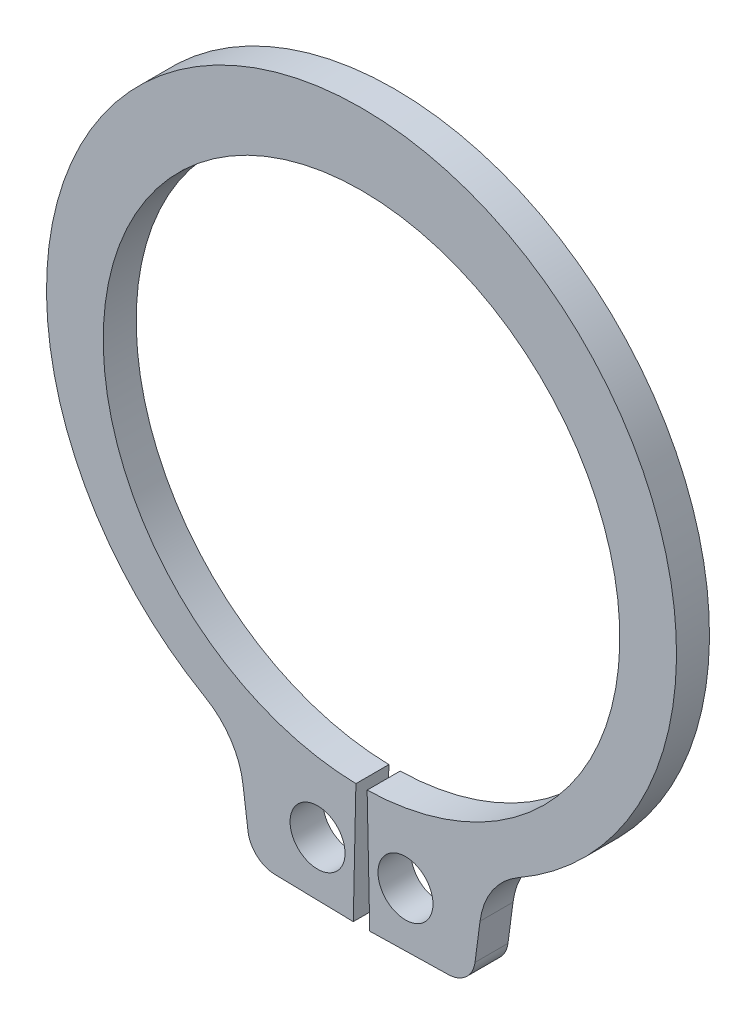
ISO-10303-21;
HEADER;
FILE_DESCRIPTION(('STEP AP214'),'2;1');
FILE_NAME('part.step','',(''),(''),'','','');
FILE_SCHEMA(('AUTOMOTIVE_DESIGN { 1 0 10303 214 1 1 1 1 }'));
ENDSEC;
DATA;
#1=APPLICATION_CONTEXT('core data for automotive mechanical design processes');
#2=APPLICATION_PROTOCOL_DEFINITION('international standard','automotive_design',2000,#1);
#3=PRODUCT_CONTEXT('',#1,'mechanical');
#4=PRODUCT('Part','Part','',(#3));
#5=PRODUCT_RELATED_PRODUCT_CATEGORY('part','',(#4));
#6=PRODUCT_DEFINITION_FORMATION('','',#4);
#7=PRODUCT_DEFINITION_CONTEXT('part definition',#1,'design');
#8=PRODUCT_DEFINITION('design','',#6,#7);
#9=PRODUCT_DEFINITION_SHAPE('','',#8);
#10=(LENGTH_UNIT() NAMED_UNIT(*) SI_UNIT(.MILLI.,.METRE.));
#11=(NAMED_UNIT(*) PLANE_ANGLE_UNIT() SI_UNIT($,.RADIAN.));
#12=(NAMED_UNIT(*) SI_UNIT($,.STERADIAN.) SOLID_ANGLE_UNIT());
#13=UNCERTAINTY_MEASURE_WITH_UNIT(LENGTH_MEASURE(1.E-05),#10,'distance_accuracy_value','');
#14=(GEOMETRIC_REPRESENTATION_CONTEXT(3) GLOBAL_UNCERTAINTY_ASSIGNED_CONTEXT((#13)) GLOBAL_UNIT_ASSIGNED_CONTEXT((#10,
#11,#12)) REPRESENTATION_CONTEXT('',''));
#15=CARTESIAN_POINT('',(0.,0.,0.));
#16=DIRECTION('',(0.,0.,1.));
#17=DIRECTION('',(1.,0.,0.));
#18=AXIS2_PLACEMENT_3D('',#15,#16,#17);
#19=CARTESIAN_POINT('',(0.,0.,-0.6));
#20=DIRECTION('',(0.,0.,1.));
#21=DIRECTION('',(1.,0.,0.));
#22=AXIS2_PLACEMENT_3D('',#19,#20,#21);
#23=CYLINDRICAL_SURFACE('',#22,4.7);
#24=CARTESIAN_POINT('',(0.,0.,0.));
#25=DIRECTION('',(0.,0.,-1.));
#26=DIRECTION('',(1.,0.,0.));
#27=AXIS2_PLACEMENT_3D('',#24,#25,#26);
#28=CIRCLE('',#27,4.7);
#29=CARTESIAN_POINT('',(-0.102173913043478,-4.69888928274474,0.));
#30=VERTEX_POINT('',#29);
#31=CARTESIAN_POINT('',(0.102173913043478,-4.69888928274474,0.));
#32=VERTEX_POINT('',#31);
#33=EDGE_CURVE('E151',#30,#32,#28,.T.);
#34=ORIENTED_EDGE('',*,*,#33,.F.);
#35=DIRECTION('',(0.,0.,1.));
#36=VECTOR('',#35,1.);
#37=CARTESIAN_POINT('',(-0.102173913043478,-4.69888928274474,-0.6));
#38=LINE('',#37,#36);
#39=CARTESIAN_POINT('',(-0.102173913043478,-4.69888928274474,-0.6));
#40=VERTEX_POINT('',#39);
#41=EDGE_CURVE('E11',#40,#30,#38,.T.);
#42=ORIENTED_EDGE('',*,*,#41,.F.);
#43=CARTESIAN_POINT('',(0.,0.,-0.6));
#44=DIRECTION('',(0.,0.,-1.));
#45=DIRECTION('',(1.,0.,0.));
#46=AXIS2_PLACEMENT_3D('',#43,#44,#45);
#47=CIRCLE('',#46,4.7);
#48=CARTESIAN_POINT('',(0.102173913043478,-4.69888928274474,-0.6));
#49=VERTEX_POINT('',#48);
#50=EDGE_CURVE('E184',#40,#49,#47,.T.);
#51=ORIENTED_EDGE('',*,*,#50,.T.);
#52=DIRECTION('',(0.,0.,1.));
#53=VECTOR('',#52,1.);
#54=CARTESIAN_POINT('',(0.102173913043478,-4.69888928274474,-0.6));
#55=LINE('',#54,#53);
#56=EDGE_CURVE('E33',#49,#32,#55,.T.);
#57=ORIENTED_EDGE('',*,*,#56,.T.);
#58=EDGE_LOOP('',(#34,#42,#51,#57));
#59=FACE_BOUND('',#58,.T.);
#60=ADVANCED_FACE('F30',(#59),#23,.F.);
#61=CARTESIAN_POINT('',(-0.102173913043478,-4.69888928274474,-0.6));
#62=DIRECTION('',(0.999763677179732,-0.0217391304347826,0.));
#63=DIRECTION('',(0.0217391304347826,0.999763677179732,0.));
#64=AXIS2_PLACEMENT_3D('',#61,#62,#63);
#65=PLANE('',#64);
#66=DIRECTION('',(0.0217391304347826,0.999763677179732,0.));
#67=VECTOR('',#66,1.);
#68=CARTESIAN_POINT('',(-0.102173913043478,-4.69888928274474,0.));
#69=LINE('',#68,#67);
#70=CARTESIAN_POINT('',(-0.15,-6.89836937254015,0.));
#71=VERTEX_POINT('',#70);
#72=EDGE_CURVE('E182',#71,#30,#69,.T.);
#73=ORIENTED_EDGE('',*,*,#72,.F.);
#74=DIRECTION('',(0.,0.,1.));
#75=VECTOR('',#74,1.);
#76=CARTESIAN_POINT('',(-0.15,-6.89836937254015,-0.6));
#77=LINE('',#76,#75);
#78=CARTESIAN_POINT('',(-0.15,-6.89836937254015,-0.6));
#79=VERTEX_POINT('',#78);
#80=EDGE_CURVE('E39',#79,#71,#77,.T.);
#81=ORIENTED_EDGE('',*,*,#80,.F.);
#82=DIRECTION('',(0.0217391304347826,0.999763677179732,0.));
#83=VECTOR('',#82,1.);
#84=CARTESIAN_POINT('',(-0.102173913043478,-4.69888928274474,-0.6));
#85=LINE('',#84,#83);
#86=EDGE_CURVE('E141',#79,#40,#85,.T.);
#87=ORIENTED_EDGE('',*,*,#86,.T.);
#88=ORIENTED_EDGE('',*,*,#41,.T.);
#89=EDGE_LOOP('',(#73,#81,#87,#88));
#90=FACE_BOUND('',#89,.T.);
#91=ADVANCED_FACE('F204',(#90),#65,.T.);
#92=CARTESIAN_POINT('',(-0.15,-6.89836937254015,-0.6));
#93=DIRECTION('',(-0.0217391304347823,-0.999763677179732,0.));
#94=DIRECTION('',(0.999763677179732,-0.0217391304347823,0.));
#95=AXIS2_PLACEMENT_3D('',#92,#93,#94);
#96=PLANE('',#95);
#97=DIRECTION('',(0.999763677179732,-0.0217391304347823,0.));
#98=VECTOR('',#97,1.);
#99=CARTESIAN_POINT('',(-0.15,-6.89836937254015,0.));
#100=LINE('',#99,#98);
#101=CARTESIAN_POINT('',(-1.58019734958143,-6.8672707765022,0.));
#102=VERTEX_POINT('',#101);
#103=EDGE_CURVE('E128',#102,#71,#100,.T.);
#104=ORIENTED_EDGE('',*,*,#103,.F.);
#105=DIRECTION('',(0.,0.,1.));
#106=VECTOR('',#105,1.);
#107=CARTESIAN_POINT('',(-1.58019734958143,-6.8672707765022,-0.6));
#108=LINE('',#107,#106);
#109=CARTESIAN_POINT('',(-1.58019734958143,-6.8672707765022,-0.6));
#110=VERTEX_POINT('',#109);
#111=EDGE_CURVE('E123',#110,#102,#108,.T.);
#112=ORIENTED_EDGE('',*,*,#111,.F.);
#113=DIRECTION('',(0.999763677179732,-0.0217391304347823,0.));
#114=VECTOR('',#113,1.);
#115=CARTESIAN_POINT('',(-0.15,-6.89836937254015,-0.6));
#116=LINE('',#115,#114);
#117=EDGE_CURVE('E126',#110,#79,#116,.T.);
#118=ORIENTED_EDGE('',*,*,#117,.T.);
#119=ORIENTED_EDGE('',*,*,#80,.T.);
#120=EDGE_LOOP('',(#104,#112,#118,#119));
#121=FACE_BOUND('',#120,.T.);
#122=ADVANCED_FACE('F125',(#121),#96,.T.);
#123=CARTESIAN_POINT('',(-1.56932778436404,-6.36738893791234,-0.6));
#124=DIRECTION('',(0.,0.,1.));
#125=DIRECTION('',(1.,0.,0.));
#126=AXIS2_PLACEMENT_3D('',#123,#124,#125);
#127=CYLINDRICAL_SURFACE('',#126,0.499999999999999);
#128=CARTESIAN_POINT('',(-1.56932778436404,-6.36738893791234,0.));
#129=DIRECTION('',(0.,0.,1.));
#130=DIRECTION('',(1.,0.,0.));
#131=AXIS2_PLACEMENT_3D('',#128,#129,#130);
#132=CIRCLE('',#131,0.499999999999999);
#133=CARTESIAN_POINT('',(-2.06505021505094,-6.43265203402236,0.));
#134=VERTEX_POINT('',#133);
#135=EDGE_CURVE('E179',#134,#102,#132,.T.);
#136=ORIENTED_EDGE('',*,*,#135,.F.);
#137=DIRECTION('',(0.,0.,1.));
#138=VECTOR('',#137,1.);
#139=CARTESIAN_POINT('',(-2.06505021505094,-6.43265203402236,-0.6));
#140=LINE('',#139,#138);
#141=CARTESIAN_POINT('',(-2.06505021505094,-6.43265203402236,-0.6));
#142=VERTEX_POINT('',#141);
#143=EDGE_CURVE('E133',#142,#134,#140,.T.);
#144=ORIENTED_EDGE('',*,*,#143,.F.);
#145=CARTESIAN_POINT('',(-1.56932778436404,-6.36738893791234,-0.6));
#146=DIRECTION('',(0.,0.,1.));
#147=DIRECTION('',(1.,0.,0.));
#148=AXIS2_PLACEMENT_3D('',#145,#146,#147);
#149=CIRCLE('',#148,0.499999999999999);
#150=EDGE_CURVE('E139',#142,#110,#149,.T.);
#151=ORIENTED_EDGE('',*,*,#150,.T.);
#152=ORIENTED_EDGE('',*,*,#111,.T.);
#153=EDGE_LOOP('',(#136,#144,#151,#152));
#154=FACE_BOUND('',#153,.T.);
#155=ADVANCED_FACE('F143',(#154),#127,.T.);
#156=CARTESIAN_POINT('',(-2.15657528293658,-5.73745012321261,-0.6));
#157=DIRECTION('',(-0.99144486137381,-0.130526192220053,0.));
#158=DIRECTION('',(0.130526192220053,-0.99144486137381,0.));
#159=AXIS2_PLACEMENT_3D('',#156,#157,#158);
#160=PLANE('',#159);
#161=DIRECTION('',(0.130526192220053,-0.99144486137381,0.));
#162=VECTOR('',#161,1.);
#163=CARTESIAN_POINT('',(-2.15657528293658,-5.73745012321261,0.));
#164=LINE('',#163,#162);
#165=CARTESIAN_POINT('',(-2.15657528293658,-5.73745012321261,0.));
#166=VERTEX_POINT('',#165);
#167=EDGE_CURVE('E176',#166,#134,#164,.T.);
#168=ORIENTED_EDGE('',*,*,#167,.F.);
#169=DIRECTION('',(0.,0.,1.));
#170=VECTOR('',#169,1.);
#171=CARTESIAN_POINT('',(-2.15657528293658,-5.73745012321261,-0.6));
#172=LINE('',#171,#170);
#173=CARTESIAN_POINT('',(-2.15657528293658,-5.73745012321261,-0.6));
#174=VERTEX_POINT('',#173);
#175=EDGE_CURVE('E188',#174,#166,#172,.T.);
#176=ORIENTED_EDGE('',*,*,#175,.F.);
#177=DIRECTION('',(0.130526192220053,-0.99144486137381,0.));
#178=VECTOR('',#177,1.);
#179=CARTESIAN_POINT('',(-2.15657528293658,-5.73745012321261,-0.6));
#180=LINE('',#179,#178);
#181=EDGE_CURVE('E144',#174,#142,#180,.T.);
#182=ORIENTED_EDGE('',*,*,#181,.T.);
#183=ORIENTED_EDGE('',*,*,#143,.T.);
#184=EDGE_LOOP('',(#168,#176,#182,#183));
#185=FACE_BOUND('',#184,.T.);
#186=ADVANCED_FACE('F217',(#185),#160,.T.);
#187=CARTESIAN_POINT('',(-3.54427577506706,-5.92014435890484,-0.6));
#188=DIRECTION('',(0.,0.,1.));
#189=DIRECTION('',(1.,0.,0.));
#190=AXIS2_PLACEMENT_3D('',#187,#188,#189);
#191=CYLINDRICAL_SURFACE('',#190,1.39967490497413);
#192=CARTESIAN_POINT('',(-3.54427577506706,-5.92014435890484,0.));
#193=DIRECTION('',(0.,0.,-1.));
#194=DIRECTION('',(1.,0.,0.));
#195=AXIS2_PLACEMENT_3D('',#192,#193,#194);
#196=CIRCLE('',#195,1.39967490497413);
#197=CARTESIAN_POINT('',(-2.84864894432097,-4.70556906195513,0.));
#198=VERTEX_POINT('',#197);
#199=EDGE_CURVE('E173',#198,#166,#196,.T.);
#200=ORIENTED_EDGE('',*,*,#199,.F.);
#201=DIRECTION('',(0.,0.,1.));
#202=VECTOR('',#201,1.);
#203=CARTESIAN_POINT('',(-2.84864894432097,-4.70556906195513,-0.6));
#204=LINE('',#203,#202);
#205=CARTESIAN_POINT('',(-2.84864894432097,-4.70556906195513,-0.6));
#206=VERTEX_POINT('',#205);
#207=EDGE_CURVE('E190',#206,#198,#204,.T.);
#208=ORIENTED_EDGE('',*,*,#207,.F.);
#209=CARTESIAN_POINT('',(-3.54427577506706,-5.92014435890484,-0.6));
#210=DIRECTION('',(0.,0.,-1.));
#211=DIRECTION('',(1.,0.,0.));
#212=AXIS2_PLACEMENT_3D('',#209,#210,#211);
#213=CIRCLE('',#212,1.39967490497413);
#214=EDGE_CURVE('E146',#206,#174,#213,.T.);
#215=ORIENTED_EDGE('',*,*,#214,.T.);
#216=ORIENTED_EDGE('',*,*,#175,.T.);
#217=EDGE_LOOP('',(#200,#208,#215,#216));
#218=FACE_BOUND('',#217,.T.);
#219=ADVANCED_FACE('F220',(#218),#191,.F.);
#220=CARTESIAN_POINT('',(0.,0.268216428382042,-0.6));
#221=DIRECTION('',(0.,0.,1.));
#222=DIRECTION('',(1.,0.,0.));
#223=AXIS2_PLACEMENT_3D('',#220,#221,#222);
#224=CYLINDRICAL_SURFACE('',#223,5.73178357161796);
#225=CARTESIAN_POINT('',(0.,0.268216428382042,0.));
#226=DIRECTION('',(0.,0.,1.));
#227=DIRECTION('',(1.,0.,0.));
#228=AXIS2_PLACEMENT_3D('',#225,#226,#227);
#229=CIRCLE('',#228,5.73178357161796);
#230=CARTESIAN_POINT('',(2.84864894432096,-4.70556906195513,0.));
#231=VERTEX_POINT('',#230);
#232=EDGE_CURVE('E170',#231,#198,#229,.T.);
#233=ORIENTED_EDGE('',*,*,#232,.F.);
#234=DIRECTION('',(0.,0.,1.));
#235=VECTOR('',#234,1.);
#236=CARTESIAN_POINT('',(2.84864894432096,-4.70556906195513,-0.6));
#237=LINE('',#236,#235);
#238=CARTESIAN_POINT('',(2.84864894432096,-4.70556906195513,-0.6));
#239=VERTEX_POINT('',#238);
#240=EDGE_CURVE('E192',#239,#231,#237,.T.);
#241=ORIENTED_EDGE('',*,*,#240,.F.);
#242=CARTESIAN_POINT('',(0.,0.268216428382042,-0.6));
#243=DIRECTION('',(0.,0.,1.));
#244=DIRECTION('',(1.,0.,0.));
#245=AXIS2_PLACEMENT_3D('',#242,#243,#244);
#246=CIRCLE('',#245,5.73178357161796);
#247=EDGE_CURVE('E294',#239,#206,#246,.T.);
#248=ORIENTED_EDGE('',*,*,#247,.T.);
#249=ORIENTED_EDGE('',*,*,#207,.T.);
#250=EDGE_LOOP('',(#233,#241,#248,#249));
#251=FACE_BOUND('',#250,.T.);
#252=ADVANCED_FACE('F224',(#251),#224,.T.);
#253=CARTESIAN_POINT('',(3.54427577506706,-5.92014435890484,-0.6));
#254=DIRECTION('',(0.,0.,1.));
#255=DIRECTION('',(1.,0.,0.));
#256=AXIS2_PLACEMENT_3D('',#253,#254,#255);
#257=CYLINDRICAL_SURFACE('',#256,1.39967490497413);
#258=CARTESIAN_POINT('',(3.54427577506706,-5.92014435890484,0.));
#259=DIRECTION('',(0.,0.,-1.));
#260=DIRECTION('',(1.,0.,0.));
#261=AXIS2_PLACEMENT_3D('',#258,#259,#260);
#262=CIRCLE('',#261,1.39967490497413);
#263=CARTESIAN_POINT('',(2.15657528293658,-5.73745012321261,0.));
#264=VERTEX_POINT('',#263);
#265=EDGE_CURVE('E167',#264,#231,#262,.T.);
#266=ORIENTED_EDGE('',*,*,#265,.F.);
#267=DIRECTION('',(0.,0.,1.));
#268=VECTOR('',#267,1.);
#269=CARTESIAN_POINT('',(2.15657528293658,-5.73745012321261,-0.6));
#270=LINE('',#269,#268);
#271=CARTESIAN_POINT('',(2.15657528293658,-5.73745012321261,-0.6));
#272=VERTEX_POINT('',#271);
#273=EDGE_CURVE('E194',#272,#264,#270,.T.);
#274=ORIENTED_EDGE('',*,*,#273,.F.);
#275=CARTESIAN_POINT('',(3.54427577506706,-5.92014435890484,-0.6));
#276=DIRECTION('',(0.,0.,-1.));
#277=DIRECTION('',(1.,0.,0.));
#278=AXIS2_PLACEMENT_3D('',#275,#276,#277);
#279=CIRCLE('',#278,1.39967490497413);
#280=EDGE_CURVE('E291',#272,#239,#279,.T.);
#281=ORIENTED_EDGE('',*,*,#280,.T.);
#282=ORIENTED_EDGE('',*,*,#240,.T.);
#283=EDGE_LOOP('',(#266,#274,#281,#282));
#284=FACE_BOUND('',#283,.T.);
#285=ADVANCED_FACE('F228',(#284),#257,.F.);
#286=CARTESIAN_POINT('',(2.15657528293658,-5.73745012321261,-0.6));
#287=DIRECTION('',(0.99144486137381,-0.130526192220053,0.));
#288=DIRECTION('',(0.130526192220053,0.99144486137381,0.));
#289=AXIS2_PLACEMENT_3D('',#286,#287,#288);
#290=PLANE('',#289);
#291=DIRECTION('',(0.130526192220053,0.99144486137381,0.));
#292=VECTOR('',#291,1.);
#293=CARTESIAN_POINT('',(2.15657528293658,-5.73745012321261,0.));
#294=LINE('',#293,#292);
#295=CARTESIAN_POINT('',(2.06505021505095,-6.43265203402236,0.));
#296=VERTEX_POINT('',#295);
#297=EDGE_CURVE('E164',#296,#264,#294,.T.);
#298=ORIENTED_EDGE('',*,*,#297,.F.);
#299=DIRECTION('',(0.,0.,1.));
#300=VECTOR('',#299,1.);
#301=CARTESIAN_POINT('',(2.06505021505095,-6.43265203402236,-0.6));
#302=LINE('',#301,#300);
#303=CARTESIAN_POINT('',(2.06505021505095,-6.43265203402236,-0.6));
#304=VERTEX_POINT('',#303);
#305=EDGE_CURVE('E196',#304,#296,#302,.T.);
#306=ORIENTED_EDGE('',*,*,#305,.F.);
#307=DIRECTION('',(0.130526192220053,0.99144486137381,0.));
#308=VECTOR('',#307,1.);
#309=CARTESIAN_POINT('',(2.15657528293658,-5.73745012321261,-0.6));
#310=LINE('',#309,#308);
#311=EDGE_CURVE('E288',#304,#272,#310,.T.);
#312=ORIENTED_EDGE('',*,*,#311,.T.);
#313=ORIENTED_EDGE('',*,*,#273,.T.);
#314=EDGE_LOOP('',(#298,#306,#312,#313));
#315=FACE_BOUND('',#314,.T.);
#316=ADVANCED_FACE('F232',(#315),#290,.T.);
#317=CARTESIAN_POINT('',(1.56932778436404,-6.36738893791234,-0.6));
#318=DIRECTION('',(0.,0.,1.));
#319=DIRECTION('',(1.,0.,0.));
#320=AXIS2_PLACEMENT_3D('',#317,#318,#319);
#321=CYLINDRICAL_SURFACE('',#320,0.499999999999999);
#322=CARTESIAN_POINT('',(1.56932778436404,-6.36738893791234,0.));
#323=DIRECTION('',(0.,0.,1.));
#324=DIRECTION('',(-1.,0.,0.));
#325=AXIS2_PLACEMENT_3D('',#322,#323,#324);
#326=CIRCLE('',#325,0.499999999999999);
#327=CARTESIAN_POINT('',(1.58019734958143,-6.8672707765022,0.));
#328=VERTEX_POINT('',#327);
#329=EDGE_CURVE('E161',#328,#296,#326,.T.);
#330=ORIENTED_EDGE('',*,*,#329,.F.);
#331=DIRECTION('',(0.,0.,1.));
#332=VECTOR('',#331,1.);
#333=CARTESIAN_POINT('',(1.58019734958143,-6.8672707765022,-0.6));
#334=LINE('',#333,#332);
#335=CARTESIAN_POINT('',(1.58019734958143,-6.8672707765022,-0.6));
#336=VERTEX_POINT('',#335);
#337=EDGE_CURVE('E198',#336,#328,#334,.T.);
#338=ORIENTED_EDGE('',*,*,#337,.F.);
#339=CARTESIAN_POINT('',(1.56932778436404,-6.36738893791234,-0.6));
#340=DIRECTION('',(0.,0.,1.));
#341=DIRECTION('',(-1.,0.,0.));
#342=AXIS2_PLACEMENT_3D('',#339,#340,#341);
#343=CIRCLE('',#342,0.499999999999999);
#344=EDGE_CURVE('E285',#336,#304,#343,.T.);
#345=ORIENTED_EDGE('',*,*,#344,.T.);
#346=ORIENTED_EDGE('',*,*,#305,.T.);
#347=EDGE_LOOP('',(#330,#338,#345,#346));
#348=FACE_BOUND('',#347,.T.);
#349=ADVANCED_FACE('F236',(#348),#321,.T.);
#350=CARTESIAN_POINT('',(0.15,-6.89836937254015,-0.6));
#351=DIRECTION('',(0.0217391304347823,-0.999763677179732,0.));
#352=DIRECTION('',(0.999763677179732,0.0217391304347823,0.));
#353=AXIS2_PLACEMENT_3D('',#350,#351,#352);
#354=PLANE('',#353);
#355=DIRECTION('',(0.999763677179732,0.0217391304347823,0.));
#356=VECTOR('',#355,1.);
#357=CARTESIAN_POINT('',(0.15,-6.89836937254015,0.));
#358=LINE('',#357,#356);
#359=CARTESIAN_POINT('',(0.15,-6.89836937254015,0.));
#360=VERTEX_POINT('',#359);
#361=EDGE_CURVE('E158',#360,#328,#358,.T.);
#362=ORIENTED_EDGE('',*,*,#361,.F.);
#363=DIRECTION('',(0.,0.,1.));
#364=VECTOR('',#363,1.);
#365=CARTESIAN_POINT('',(0.15,-6.89836937254015,-0.6));
#366=LINE('',#365,#364);
#367=CARTESIAN_POINT('',(0.15,-6.89836937254015,-0.6));
#368=VERTEX_POINT('',#367);
#369=EDGE_CURVE('E199',#368,#360,#366,.T.);
#370=ORIENTED_EDGE('',*,*,#369,.F.);
#371=DIRECTION('',(0.999763677179732,0.0217391304347823,0.));
#372=VECTOR('',#371,1.);
#373=CARTESIAN_POINT('',(0.15,-6.89836937254015,-0.6));
#374=LINE('',#373,#372);
#375=EDGE_CURVE('E282',#368,#336,#374,.T.);
#376=ORIENTED_EDGE('',*,*,#375,.T.);
#377=ORIENTED_EDGE('',*,*,#337,.T.);
#378=EDGE_LOOP('',(#362,#370,#376,#377));
#379=FACE_BOUND('',#378,.T.);
#380=ADVANCED_FACE('F240',(#379),#354,.T.);
#381=CARTESIAN_POINT('',(0.102173913043478,-4.69888928274474,-0.6));
#382=DIRECTION('',(-0.999763677179732,-0.0217391304347826,0.));
#383=DIRECTION('',(0.0217391304347826,-0.999763677179732,0.));
#384=AXIS2_PLACEMENT_3D('',#381,#382,#383);
#385=PLANE('',#384);
#386=DIRECTION('',(0.0217391304347826,-0.999763677179732,0.));
#387=VECTOR('',#386,1.);
#388=CARTESIAN_POINT('',(0.102173913043478,-4.69888928274474,0.));
#389=LINE('',#388,#387);
#390=EDGE_CURVE('E154',#32,#360,#389,.T.);
#391=ORIENTED_EDGE('',*,*,#390,.F.);
#392=ORIENTED_EDGE('',*,*,#56,.F.);
#393=DIRECTION('',(0.0217391304347826,-0.999763677179732,0.));
#394=VECTOR('',#393,1.);
#395=CARTESIAN_POINT('',(0.102173913043478,-4.69888928274474,-0.6));
#396=LINE('',#395,#394);
#397=EDGE_CURVE('E280',#49,#368,#396,.T.);
#398=ORIENTED_EDGE('',*,*,#397,.T.);
#399=ORIENTED_EDGE('',*,*,#369,.T.);
#400=EDGE_LOOP('',(#391,#392,#398,#399));
#401=FACE_BOUND('',#400,.T.);
#402=ADVANCED_FACE('F201',(#401),#385,.T.);
#403=CARTESIAN_POINT('',(0.,0.,-0.6));
#404=DIRECTION('',(0.,0.,1.));
#405=DIRECTION('',(1.,0.,0.));
#406=AXIS2_PLACEMENT_3D('',#403,#404,#405);
#407=PLANE('',#406);
#408=CARTESIAN_POINT('',(-0.8,-5.89597320211006,-0.6));
#409=DIRECTION('',(0.,0.,1.));
#410=DIRECTION('',(1.,0.,0.));
#411=AXIS2_PLACEMENT_3D('',#408,#409,#410);
#412=CIRCLE('',#411,0.5);
#413=CARTESIAN_POINT('',(-0.3,-5.89597320211006,-0.6));
#414=VERTEX_POINT('',#413);
#415=EDGE_CURVE('E267',#414,#414,#412,.T.);
#416=ORIENTED_EDGE('',*,*,#415,.T.);
#417=EDGE_LOOP('',(#416));
#418=FACE_BOUND('',#417,.T.);
#419=CARTESIAN_POINT('',(0.8,-5.89597320211006,-0.6));
#420=DIRECTION('',(0.,0.,1.));
#421=DIRECTION('',(1.,0.,0.));
#422=AXIS2_PLACEMENT_3D('',#419,#420,#421);
#423=CIRCLE('',#422,0.5);
#424=CARTESIAN_POINT('',(1.3,-5.89597320211006,-0.6));
#425=VERTEX_POINT('',#424);
#426=EDGE_CURVE('E155',#425,#425,#423,.T.);
#427=ORIENTED_EDGE('',*,*,#426,.T.);
#428=EDGE_LOOP('',(#427));
#429=FACE_BOUND('',#428,.T.);
#430=ORIENTED_EDGE('',*,*,#50,.F.);
#431=ORIENTED_EDGE('',*,*,#86,.F.);
#432=ORIENTED_EDGE('',*,*,#117,.F.);
#433=ORIENTED_EDGE('',*,*,#150,.F.);
#434=ORIENTED_EDGE('',*,*,#181,.F.);
#435=ORIENTED_EDGE('',*,*,#214,.F.);
#436=ORIENTED_EDGE('',*,*,#247,.F.);
#437=ORIENTED_EDGE('',*,*,#280,.F.);
#438=ORIENTED_EDGE('',*,*,#311,.F.);
#439=ORIENTED_EDGE('',*,*,#344,.F.);
#440=ORIENTED_EDGE('',*,*,#375,.F.);
#441=ORIENTED_EDGE('',*,*,#397,.F.);
#442=EDGE_LOOP('',(#430,#431,#432,#433,#434,#435,#436,#437,#438,#439,#440,#441));
#443=FACE_BOUND('',#442,.T.);
#444=ADVANCED_FACE('F137',(#418,#429,#443),#407,.F.);
#445=CARTESIAN_POINT('',(0.,0.,0.));
#446=DIRECTION('',(0.,0.,1.));
#447=DIRECTION('',(1.,0.,0.));
#448=AXIS2_PLACEMENT_3D('',#445,#446,#447);
#449=PLANE('',#448);
#450=CARTESIAN_POINT('',(-0.8,-5.89597320211006,0.));
#451=DIRECTION('',(0.,0.,1.));
#452=DIRECTION('',(1.,0.,0.));
#453=AXIS2_PLACEMENT_3D('',#450,#451,#452);
#454=CIRCLE('',#453,0.5);
#455=CARTESIAN_POINT('',(-0.3,-5.89597320211006,0.));
#456=VERTEX_POINT('',#455);
#457=EDGE_CURVE('E270',#456,#456,#454,.T.);
#458=ORIENTED_EDGE('',*,*,#457,.F.);
#459=EDGE_LOOP('',(#458));
#460=FACE_BOUND('',#459,.T.);
#461=CARTESIAN_POINT('',(0.8,-5.89597320211006,0.));
#462=DIRECTION('',(0.,0.,1.));
#463=DIRECTION('',(1.,0.,0.));
#464=AXIS2_PLACEMENT_3D('',#461,#462,#463);
#465=CIRCLE('',#464,0.5);
#466=CARTESIAN_POINT('',(1.3,-5.89597320211006,0.));
#467=VERTEX_POINT('',#466);
#468=EDGE_CURVE('E272',#467,#467,#465,.T.);
#469=ORIENTED_EDGE('',*,*,#468,.F.);
#470=EDGE_LOOP('',(#469));
#471=FACE_BOUND('',#470,.T.);
#472=ORIENTED_EDGE('',*,*,#33,.T.);
#473=ORIENTED_EDGE('',*,*,#390,.T.);
#474=ORIENTED_EDGE('',*,*,#361,.T.);
#475=ORIENTED_EDGE('',*,*,#329,.T.);
#476=ORIENTED_EDGE('',*,*,#297,.T.);
#477=ORIENTED_EDGE('',*,*,#265,.T.);
#478=ORIENTED_EDGE('',*,*,#232,.T.);
#479=ORIENTED_EDGE('',*,*,#199,.T.);
#480=ORIENTED_EDGE('',*,*,#167,.T.);
#481=ORIENTED_EDGE('',*,*,#135,.T.);
#482=ORIENTED_EDGE('',*,*,#103,.T.);
#483=ORIENTED_EDGE('',*,*,#72,.T.);
#484=EDGE_LOOP('',(#472,#473,#474,#475,#476,#477,#478,#479,#480,#481,#482,#483));
#485=FACE_BOUND('',#484,.T.);
#486=ADVANCED_FACE('F203',(#460,#471,#485),#449,.T.);
#487=CARTESIAN_POINT('',(0.8,-5.89597320211006,-0.6));
#488=DIRECTION('',(0.,0.,1.));
#489=DIRECTION('',(1.,0.,0.));
#490=AXIS2_PLACEMENT_3D('',#487,#488,#489);
#491=CYLINDRICAL_SURFACE('',#490,0.5);
#492=ORIENTED_EDGE('',*,*,#426,.F.);
#493=EDGE_LOOP('',(#492));
#494=FACE_BOUND('',#493,.T.);
#495=ORIENTED_EDGE('',*,*,#468,.T.);
#496=EDGE_LOOP('',(#495));
#497=FACE_BOUND('',#496,.T.);
#498=ADVANCED_FACE('F252',(#494,#497),#491,.F.);
#499=CARTESIAN_POINT('',(-0.8,-5.89597320211006,-0.6));
#500=DIRECTION('',(0.,0.,1.));
#501=DIRECTION('',(1.,0.,0.));
#502=AXIS2_PLACEMENT_3D('',#499,#500,#501);
#503=CYLINDRICAL_SURFACE('',#502,0.5);
#504=ORIENTED_EDGE('',*,*,#415,.F.);
#505=EDGE_LOOP('',(#504));
#506=FACE_BOUND('',#505,.T.);
#507=ORIENTED_EDGE('',*,*,#457,.T.);
#508=EDGE_LOOP('',(#507));
#509=FACE_BOUND('',#508,.T.);
#510=ADVANCED_FACE('F259',(#506,#509),#503,.F.);
#511=CLOSED_SHELL('',(#60,#91,#122,#155,#186,#219,#252,#285,#316,#349,#380,#402,#444,#486,#498,#510));
#512=MANIFOLD_SOLID_BREP('B2',#511);
#513=ADVANCED_BREP_SHAPE_REPRESENTATION('',(#18,#512),#14);
#514=SHAPE_DEFINITION_REPRESENTATION(#9,#513);
ENDSEC;
END-ISO-10303-21;
